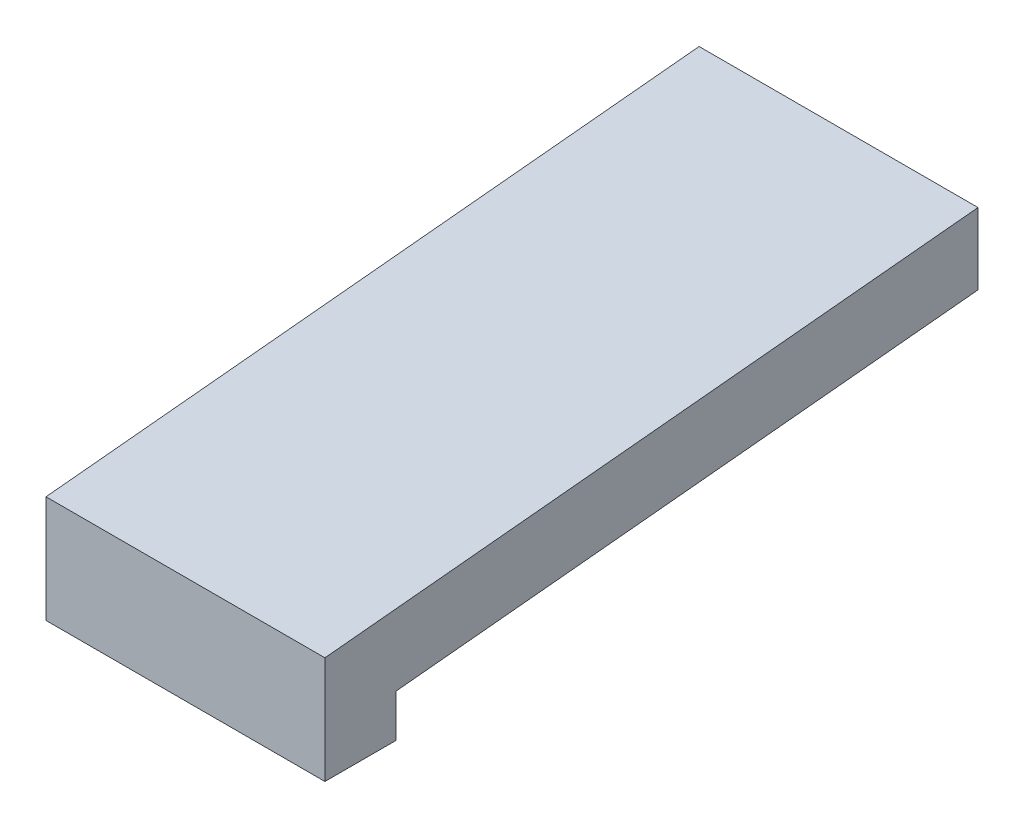
ISO-10303-21;
HEADER;
FILE_DESCRIPTION(('STEP AP214'),'2;1');
FILE_NAME('part.step','',(''),(''),'','','');
FILE_SCHEMA(('AUTOMOTIVE_DESIGN { 1 0 10303 214 1 1 1 1 }'));
ENDSEC;
DATA;
#1=APPLICATION_CONTEXT('core data for automotive mechanical design processes');
#2=APPLICATION_PROTOCOL_DEFINITION('international standard','automotive_design',2000,#1);
#3=PRODUCT_CONTEXT('',#1,'mechanical');
#4=PRODUCT('Part','Part','',(#3));
#5=PRODUCT_RELATED_PRODUCT_CATEGORY('part','',(#4));
#6=PRODUCT_DEFINITION_FORMATION('','',#4);
#7=PRODUCT_DEFINITION_CONTEXT('part definition',#1,'design');
#8=PRODUCT_DEFINITION('design','',#6,#7);
#9=PRODUCT_DEFINITION_SHAPE('','',#8);
#10=(LENGTH_UNIT() NAMED_UNIT(*) SI_UNIT(.MILLI.,.METRE.));
#11=(NAMED_UNIT(*) PLANE_ANGLE_UNIT() SI_UNIT($,.RADIAN.));
#12=(NAMED_UNIT(*) SI_UNIT($,.STERADIAN.) SOLID_ANGLE_UNIT());
#13=UNCERTAINTY_MEASURE_WITH_UNIT(LENGTH_MEASURE(1.E-05),#10,'distance_accuracy_value','');
#14=(GEOMETRIC_REPRESENTATION_CONTEXT(3) GLOBAL_UNCERTAINTY_ASSIGNED_CONTEXT((#13)) GLOBAL_UNIT_ASSIGNED_CONTEXT((#10,
#11,#12)) REPRESENTATION_CONTEXT('',''));
#15=CARTESIAN_POINT('',(0.,0.,0.));
#16=DIRECTION('',(0.,0.,1.));
#17=DIRECTION('',(1.,0.,0.));
#18=AXIS2_PLACEMENT_3D('',#15,#16,#17);
#19=CARTESIAN_POINT('',(2.11057050786774,-46.5120184052357,-20.6164214772802));
#20=DIRECTION('',(1.,0.,0.));
#21=DIRECTION('',(0.,1.,0.));
#22=AXIS2_PLACEMENT_3D('',#19,#20,#21);
#23=PLANE('',#22);
#24=CARTESIAN_POINT('',(2.11057050786774,-45.6073487329095,-15.4414214772803));
#25=CARTESIAN_POINT('',(2.11057050786774,-46.3618757078417,-15.4414214772803));
#26=(BOUNDED_CURVE() B_SPLINE_CURVE(1,(#24,#25),.UNSPECIFIED.,.F.,
.F.) B_SPLINE_CURVE_WITH_KNOTS((2,2),(0.,1.),
.UNSPECIFIED.) CURVE() GEOMETRIC_REPRESENTATION_ITEM() RATIONAL_B_SPLINE_CURVE((1.,1.)) REPRESENTATION_ITEM(''));
#27=CARTESIAN_POINT('',(2.11057050786774,-45.6073487329095,-15.4414214772803));
#28=VERTEX_POINT('',#27);
#29=CARTESIAN_POINT('',(2.11057050786774,-46.3618757078417,-15.4414214772803));
#30=VERTEX_POINT('',#29);
#31=EDGE_CURVE('E116',#28,#30,#26,.T.);
#32=ORIENTED_EDGE('',*,*,#31,.T.);
#33=CARTESIAN_POINT('',(2.11057050786774,-46.3618757078417,-15.4414214772803));
#34=CARTESIAN_POINT('',(2.11057050786774,-46.3618757078417,-15.9414214772803));
#35=(BOUNDED_CURVE() B_SPLINE_CURVE(1,(#33,#34),.UNSPECIFIED.,.F.,
.F.) B_SPLINE_CURVE_WITH_KNOTS((2,2),(1.,2.),
.UNSPECIFIED.) CURVE() GEOMETRIC_REPRESENTATION_ITEM() RATIONAL_B_SPLINE_CURVE((1.,1.)) REPRESENTATION_ITEM(''));
#36=CARTESIAN_POINT('',(2.11057050786774,-46.3618757078417,-15.9414214772803));
#37=VERTEX_POINT('',#36);
#38=EDGE_CURVE('E95',#30,#37,#35,.T.);
#39=ORIENTED_EDGE('',*,*,#38,.T.);
#40=CARTESIAN_POINT('',(2.11057050786774,-46.3618757078417,-15.9414214772803));
#41=CARTESIAN_POINT('',(2.11057050786774,-46.0611547629838,-15.9414214772803));
#42=(BOUNDED_CURVE() B_SPLINE_CURVE(1,(#40,#41),.UNSPECIFIED.,.F.,
.F.) B_SPLINE_CURVE_WITH_KNOTS((2,2),(2.,3.),
.UNSPECIFIED.) CURVE() GEOMETRIC_REPRESENTATION_ITEM() RATIONAL_B_SPLINE_CURVE((1.,1.)) REPRESENTATION_ITEM(''));
#43=CARTESIAN_POINT('',(2.11057050786774,-46.0611547629838,-15.9414214772803));
#44=VERTEX_POINT('',#43);
#45=EDGE_CURVE('E101',#37,#44,#42,.T.);
#46=ORIENTED_EDGE('',*,*,#45,.T.);
#47=CARTESIAN_POINT('',(2.11057050786774,-46.0611547629838,-15.9414214772803));
#48=CARTESIAN_POINT('',(2.11057050786774,-45.6630852244399,-20.0414214772802));
#49=(BOUNDED_CURVE() B_SPLINE_CURVE(1,(#47,#48),.UNSPECIFIED.,.F.,
.F.) B_SPLINE_CURVE_WITH_KNOTS((2,2),(3.,4.),
.UNSPECIFIED.) CURVE() GEOMETRIC_REPRESENTATION_ITEM() RATIONAL_B_SPLINE_CURVE((1.,1.)) REPRESENTATION_ITEM(''));
#50=CARTESIAN_POINT('',(2.11057050786774,-45.6630852244399,-20.0414214772802));
#51=VERTEX_POINT('',#50);
#52=EDGE_CURVE('E123',#44,#51,#49,.T.);
#53=ORIENTED_EDGE('',*,*,#52,.T.);
#54=CARTESIAN_POINT('',(2.11057050786774,-45.6630852244399,-20.0414214772802));
#55=CARTESIAN_POINT('',(2.11057050786774,-45.1607341286897,-20.0414214772802));
#56=(BOUNDED_CURVE() B_SPLINE_CURVE(1,(#54,#55),.UNSPECIFIED.,.F.,
.F.) B_SPLINE_CURVE_WITH_KNOTS((2,2),(4.,5.),
.UNSPECIFIED.) CURVE() GEOMETRIC_REPRESENTATION_ITEM() RATIONAL_B_SPLINE_CURVE((1.,1.)) REPRESENTATION_ITEM(''));
#57=CARTESIAN_POINT('',(2.11057050786774,-45.1607341286897,-20.0414214772802));
#58=VERTEX_POINT('',#57);
#59=EDGE_CURVE('E164',#51,#58,#56,.T.);
#60=ORIENTED_EDGE('',*,*,#59,.T.);
#61=CARTESIAN_POINT('',(2.11057050786774,-45.1607341286897,-20.0414214772802));
#62=CARTESIAN_POINT('',(2.11057050786774,-45.6073487329095,-15.4414214772803));
#63=(BOUNDED_CURVE() B_SPLINE_CURVE(1,(#61,#62),.UNSPECIFIED.,.F.,
.F.) B_SPLINE_CURVE_WITH_KNOTS((2,2),(5.,6.),
.UNSPECIFIED.) CURVE() GEOMETRIC_REPRESENTATION_ITEM() RATIONAL_B_SPLINE_CURVE((1.,1.)) REPRESENTATION_ITEM(''));
#64=EDGE_CURVE('E11',#58,#28,#63,.T.);
#65=ORIENTED_EDGE('',*,*,#64,.T.);
#66=EDGE_LOOP('',(#32,#39,#46,#53,#60,#65));
#67=FACE_BOUND('',#66,.T.);
#68=ADVANCED_FACE('F16',(#67),#23,.T.);
#69=CARTESIAN_POINT('',(0.146046976168087,-46.5120184052357,-20.6164214772802));
#70=DIRECTION('',(-1.,0.,0.));
#71=DIRECTION('',(0.,0.,1.));
#72=AXIS2_PLACEMENT_3D('',#69,#70,#71);
#73=PLANE('',#72);
#74=CARTESIAN_POINT('',(0.146046976168087,-45.1607341286897,-20.0414214772802));
#75=CARTESIAN_POINT('',(0.146046976168087,-45.6073487329095,-15.4414214772803));
#76=(BOUNDED_CURVE() B_SPLINE_CURVE(1,(#74,#75),.UNSPECIFIED.,.F.,
.F.) B_SPLINE_CURVE_WITH_KNOTS((2,2),(5.,6.),
.UNSPECIFIED.) CURVE() GEOMETRIC_REPRESENTATION_ITEM() RATIONAL_B_SPLINE_CURVE((1.,1.)) REPRESENTATION_ITEM(''));
#77=CARTESIAN_POINT('',(0.146046976168087,-45.1607341286897,-20.0414214772802));
#78=VERTEX_POINT('',#77);
#79=CARTESIAN_POINT('',(0.146046976168087,-45.6073487329095,-15.4414214772803));
#80=VERTEX_POINT('',#79);
#81=EDGE_CURVE('E29',#78,#80,#76,.T.);
#82=ORIENTED_EDGE('',*,*,#81,.F.);
#83=CARTESIAN_POINT('',(0.146046976168087,-45.6630852244399,-20.0414214772802));
#84=CARTESIAN_POINT('',(0.146046976168087,-45.1607341286897,-20.0414214772802));
#85=(BOUNDED_CURVE() B_SPLINE_CURVE(1,(#83,#84),.UNSPECIFIED.,.F.,
.F.) B_SPLINE_CURVE_WITH_KNOTS((2,2),(4.,5.),
.UNSPECIFIED.) CURVE() GEOMETRIC_REPRESENTATION_ITEM() RATIONAL_B_SPLINE_CURVE((1.,1.)) REPRESENTATION_ITEM(''));
#86=CARTESIAN_POINT('',(0.146046976168087,-45.6630852244399,-20.0414214772802));
#87=VERTEX_POINT('',#86);
#88=EDGE_CURVE('E130',#87,#78,#85,.T.);
#89=ORIENTED_EDGE('',*,*,#88,.F.);
#90=CARTESIAN_POINT('',(0.146046976168087,-46.0611547629838,-15.9414214772803));
#91=CARTESIAN_POINT('',(0.146046976168087,-45.6630852244399,-20.0414214772802));
#92=(BOUNDED_CURVE() B_SPLINE_CURVE(1,(#90,#91),.UNSPECIFIED.,.F.,
.F.) B_SPLINE_CURVE_WITH_KNOTS((2,2),(3.,4.),
.UNSPECIFIED.) CURVE() GEOMETRIC_REPRESENTATION_ITEM() RATIONAL_B_SPLINE_CURVE((1.,1.)) REPRESENTATION_ITEM(''));
#93=CARTESIAN_POINT('',(0.146046976168087,-46.0611547629838,-15.9414214772803));
#94=VERTEX_POINT('',#93);
#95=EDGE_CURVE('E89',#94,#87,#92,.T.);
#96=ORIENTED_EDGE('',*,*,#95,.F.);
#97=CARTESIAN_POINT('',(0.146046976168087,-46.3618757078417,-15.9414214772803));
#98=CARTESIAN_POINT('',(0.146046976168087,-46.0611547629838,-15.9414214772803));
#99=(BOUNDED_CURVE() B_SPLINE_CURVE(1,(#97,#98),.UNSPECIFIED.,.F.,
.F.) B_SPLINE_CURVE_WITH_KNOTS((2,2),(2.,3.),
.UNSPECIFIED.) CURVE() GEOMETRIC_REPRESENTATION_ITEM() RATIONAL_B_SPLINE_CURVE((1.,1.)) REPRESENTATION_ITEM(''));
#100=CARTESIAN_POINT('',(0.146046976168087,-46.3618757078417,-15.9414214772803));
#101=VERTEX_POINT('',#100);
#102=EDGE_CURVE('E80',#101,#94,#99,.T.);
#103=ORIENTED_EDGE('',*,*,#102,.F.);
#104=CARTESIAN_POINT('',(0.146046976168087,-46.3618757078417,-15.4414214772803));
#105=CARTESIAN_POINT('',(0.146046976168087,-46.3618757078417,-15.9414214772803));
#106=(BOUNDED_CURVE() B_SPLINE_CURVE(1,(#104,#105),.UNSPECIFIED.,.F.,
.F.) B_SPLINE_CURVE_WITH_KNOTS((2,2),(1.,2.),
.UNSPECIFIED.) CURVE() GEOMETRIC_REPRESENTATION_ITEM() RATIONAL_B_SPLINE_CURVE((1.,1.)) REPRESENTATION_ITEM(''));
#107=CARTESIAN_POINT('',(0.146046976168087,-46.3618757078417,-15.4414214772803));
#108=VERTEX_POINT('',#107);
#109=EDGE_CURVE('E85',#108,#101,#106,.T.);
#110=ORIENTED_EDGE('',*,*,#109,.F.);
#111=CARTESIAN_POINT('',(0.146046976168087,-45.6073487329095,-15.4414214772803));
#112=CARTESIAN_POINT('',(0.146046976168087,-46.3618757078417,-15.4414214772803));
#113=(BOUNDED_CURVE() B_SPLINE_CURVE(1,(#111,#112),.UNSPECIFIED.,.F.,
.F.) B_SPLINE_CURVE_WITH_KNOTS((2,2),(0.,1.),
.UNSPECIFIED.) CURVE() GEOMETRIC_REPRESENTATION_ITEM() RATIONAL_B_SPLINE_CURVE((1.,1.)) REPRESENTATION_ITEM(''));
#114=EDGE_CURVE('E179',#80,#108,#113,.T.);
#115=ORIENTED_EDGE('',*,*,#114,.F.);
#116=EDGE_LOOP('',(#82,#89,#96,#103,#110,#115));
#117=FACE_BOUND('',#116,.T.);
#118=ADVANCED_FACE('F82',(#117),#73,.T.);
#119=CARTESIAN_POINT('',(0.146046976168087,-45.1607341286897,-20.0414214772802));
#120=DIRECTION('',(0.,0.995319815622666,0.0966357316361943));
#121=DIRECTION('',(1.,0.,0.));
#122=AXIS2_PLACEMENT_3D('',#119,#120,#121);
#123=PLANE('',#122);
#124=ORIENTED_EDGE('',*,*,#81,.T.);
#125=CARTESIAN_POINT('',(0.146046976168087,-45.6073487329095,-15.4414214772803));
#126=CARTESIAN_POINT('',(2.11057050786774,-45.6073487329095,-15.4414214772803));
#127=(BOUNDED_CURVE() B_SPLINE_CURVE(1,(#125,#126),.UNSPECIFIED.,.F.,
.F.) B_SPLINE_CURVE_WITH_KNOTS((2,2),(0.,1.96452353169965),
.UNSPECIFIED.) CURVE() GEOMETRIC_REPRESENTATION_ITEM() RATIONAL_B_SPLINE_CURVE((1.,1.)) REPRESENTATION_ITEM(''));
#128=EDGE_CURVE('E111',#80,#28,#127,.T.);
#129=ORIENTED_EDGE('',*,*,#128,.T.);
#130=ORIENTED_EDGE('',*,*,#64,.F.);
#131=CARTESIAN_POINT('',(0.146046976168087,-45.1607341286897,-20.0414214772802));
#132=CARTESIAN_POINT('',(2.11057050786774,-45.1607341286897,-20.0414214772802));
#133=(BOUNDED_CURVE() B_SPLINE_CURVE(1,(#131,#132),.UNSPECIFIED.,.F.,
.F.) B_SPLINE_CURVE_WITH_KNOTS((2,2),(0.,1.96452353169965),
.UNSPECIFIED.) CURVE() GEOMETRIC_REPRESENTATION_ITEM() RATIONAL_B_SPLINE_CURVE((1.,1.)) REPRESENTATION_ITEM(''));
#134=EDGE_CURVE('E20',#78,#58,#133,.T.);
#135=ORIENTED_EDGE('',*,*,#134,.F.);
#136=EDGE_LOOP('',(#124,#129,#130,#135));
#137=FACE_BOUND('',#136,.T.);
#138=ADVANCED_FACE('F18',(#137),#123,.T.);
#139=CARTESIAN_POINT('',(0.146046976168087,-45.6630852244399,-20.0414214772802));
#140=DIRECTION('',(0.,0.,-1.));
#141=DIRECTION('',(0.,-1.,0.));
#142=AXIS2_PLACEMENT_3D('',#139,#140,#141);
#143=PLANE('',#142);
#144=ORIENTED_EDGE('',*,*,#88,.T.);
#145=ORIENTED_EDGE('',*,*,#134,.T.);
#146=ORIENTED_EDGE('',*,*,#59,.F.);
#147=CARTESIAN_POINT('',(0.146046976168087,-45.6630852244399,-20.0414214772802));
#148=CARTESIAN_POINT('',(2.11057050786774,-45.6630852244399,-20.0414214772802));
#149=(BOUNDED_CURVE() B_SPLINE_CURVE(1,(#147,#148),.UNSPECIFIED.,.F.,
.F.) B_SPLINE_CURVE_WITH_KNOTS((2,2),(0.,1.96452353169965),
.UNSPECIFIED.) CURVE() GEOMETRIC_REPRESENTATION_ITEM() RATIONAL_B_SPLINE_CURVE((1.,1.)) REPRESENTATION_ITEM(''));
#150=EDGE_CURVE('E131',#87,#51,#149,.T.);
#151=ORIENTED_EDGE('',*,*,#150,.F.);
#152=EDGE_LOOP('',(#144,#145,#146,#151));
#153=FACE_BOUND('',#152,.T.);
#154=ADVANCED_FACE('F292',(#153),#143,.T.);
#155=CARTESIAN_POINT('',(0.146046976168087,-46.0611547629838,-15.9414214772803));
#156=DIRECTION('',(0.,-0.995319815622664,-0.0966357316362155));
#157=DIRECTION('',(0.,0.0966357316362155,-0.995319815622664));
#158=AXIS2_PLACEMENT_3D('',#155,#156,#157);
#159=PLANE('',#158);
#160=ORIENTED_EDGE('',*,*,#95,.T.);
#161=ORIENTED_EDGE('',*,*,#150,.T.);
#162=ORIENTED_EDGE('',*,*,#52,.F.);
#163=CARTESIAN_POINT('',(0.146046976168087,-46.0611547629838,-15.9414214772803));
#164=CARTESIAN_POINT('',(2.11057050786774,-46.0611547629838,-15.9414214772803));
#165=(BOUNDED_CURVE() B_SPLINE_CURVE(1,(#163,#164),.UNSPECIFIED.,.F.,
.F.) B_SPLINE_CURVE_WITH_KNOTS((2,2),(0.,1.96452353169965),
.UNSPECIFIED.) CURVE() GEOMETRIC_REPRESENTATION_ITEM() RATIONAL_B_SPLINE_CURVE((1.,1.)) REPRESENTATION_ITEM(''));
#166=EDGE_CURVE('E94',#94,#44,#165,.T.);
#167=ORIENTED_EDGE('',*,*,#166,.F.);
#168=EDGE_LOOP('',(#160,#161,#162,#167));
#169=FACE_BOUND('',#168,.T.);
#170=ADVANCED_FACE('F239',(#169),#159,.T.);
#171=CARTESIAN_POINT('',(0.146046976168087,-46.3618757078417,-15.9414214772803));
#172=DIRECTION('',(0.,0.,-1.));
#173=DIRECTION('',(0.,-1.,0.));
#174=AXIS2_PLACEMENT_3D('',#171,#172,#173);
#175=PLANE('',#174);
#176=ORIENTED_EDGE('',*,*,#102,.T.);
#177=ORIENTED_EDGE('',*,*,#166,.T.);
#178=ORIENTED_EDGE('',*,*,#45,.F.);
#179=CARTESIAN_POINT('',(0.146046976168087,-46.3618757078417,-15.9414214772803));
#180=CARTESIAN_POINT('',(2.11057050786774,-46.3618757078417,-15.9414214772803));
#181=(BOUNDED_CURVE() B_SPLINE_CURVE(1,(#179,#180),.UNSPECIFIED.,.F.,
.F.) B_SPLINE_CURVE_WITH_KNOTS((2,2),(0.,1.96452353169965),
.UNSPECIFIED.) CURVE() GEOMETRIC_REPRESENTATION_ITEM() RATIONAL_B_SPLINE_CURVE((1.,1.)) REPRESENTATION_ITEM(''));
#182=EDGE_CURVE('E98',#101,#37,#181,.T.);
#183=ORIENTED_EDGE('',*,*,#182,.F.);
#184=EDGE_LOOP('',(#176,#177,#178,#183));
#185=FACE_BOUND('',#184,.T.);
#186=ADVANCED_FACE('F99',(#185),#175,.T.);
#187=CARTESIAN_POINT('',(0.146046976168087,-46.3618757078417,-15.4414214772803));
#188=DIRECTION('',(0.,-1.,0.));
#189=DIRECTION('',(0.,0.,-1.));
#190=AXIS2_PLACEMENT_3D('',#187,#188,#189);
#191=PLANE('',#190);
#192=ORIENTED_EDGE('',*,*,#109,.T.);
#193=ORIENTED_EDGE('',*,*,#182,.T.);
#194=ORIENTED_EDGE('',*,*,#38,.F.);
#195=CARTESIAN_POINT('',(0.146046976168087,-46.3618757078417,-15.4414214772803));
#196=CARTESIAN_POINT('',(2.11057050786774,-46.3618757078417,-15.4414214772803));
#197=(BOUNDED_CURVE() B_SPLINE_CURVE(1,(#195,#196),.UNSPECIFIED.,.F.,
.F.) B_SPLINE_CURVE_WITH_KNOTS((2,2),(0.,1.96452353169965),
.UNSPECIFIED.) CURVE() GEOMETRIC_REPRESENTATION_ITEM() RATIONAL_B_SPLINE_CURVE((1.,1.)) REPRESENTATION_ITEM(''));
#198=EDGE_CURVE('E108',#108,#30,#197,.T.);
#199=ORIENTED_EDGE('',*,*,#198,.F.);
#200=EDGE_LOOP('',(#192,#193,#194,#199));
#201=FACE_BOUND('',#200,.T.);
#202=ADVANCED_FACE('F106',(#201),#191,.T.);
#203=CARTESIAN_POINT('',(0.146046976168087,-45.6073487329095,-15.4414214772803));
#204=DIRECTION('',(0.,0.,1.));
#205=DIRECTION('',(1.,0.,0.));
#206=AXIS2_PLACEMENT_3D('',#203,#204,#205);
#207=PLANE('',#206);
#208=ORIENTED_EDGE('',*,*,#114,.T.);
#209=ORIENTED_EDGE('',*,*,#198,.T.);
#210=ORIENTED_EDGE('',*,*,#31,.F.);
#211=ORIENTED_EDGE('',*,*,#128,.F.);
#212=EDGE_LOOP('',(#208,#209,#210,#211));
#213=FACE_BOUND('',#212,.T.);
#214=ADVANCED_FACE('F296',(#213),#207,.T.);
#215=CLOSED_SHELL('',(#68,#118,#138,#154,#170,#186,#202,#214));
#216=MANIFOLD_SOLID_BREP('B1',#215);
#217=ADVANCED_BREP_SHAPE_REPRESENTATION('',(#18,#216),#14);
#218=SHAPE_DEFINITION_REPRESENTATION(#9,#217);
ENDSEC;
END-ISO-10303-21;
